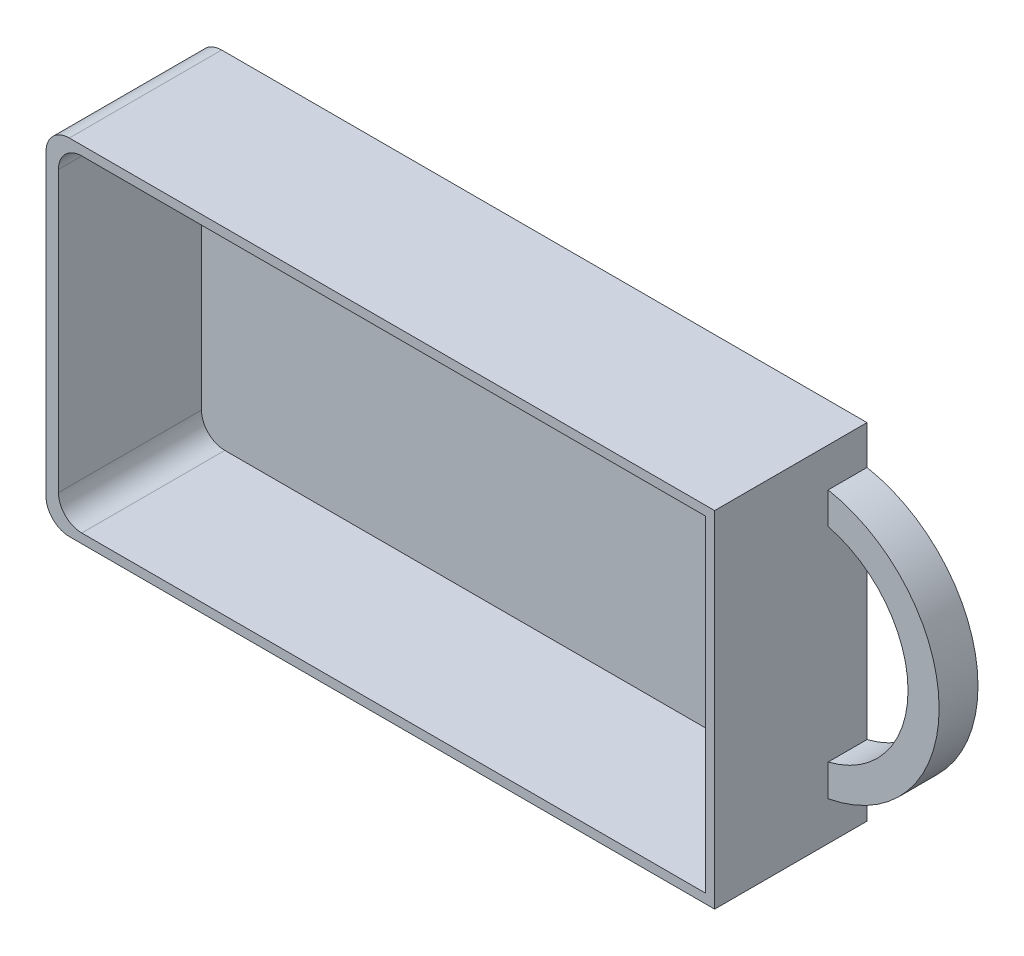
ISO-10303-21;
HEADER;
FILE_DESCRIPTION(('STEP AP214'),'2;1');
FILE_NAME('part.step','',(''),(''),'','','');
FILE_SCHEMA(('AUTOMOTIVE_DESIGN { 1 0 10303 214 1 1 1 1 }'));
ENDSEC;
DATA;
#1=APPLICATION_CONTEXT('core data for automotive mechanical design processes');
#2=APPLICATION_PROTOCOL_DEFINITION('international standard','automotive_design',2000,#1);
#3=PRODUCT_CONTEXT('',#1,'mechanical');
#4=PRODUCT('Part','Part','',(#3));
#5=PRODUCT_RELATED_PRODUCT_CATEGORY('part','',(#4));
#6=PRODUCT_DEFINITION_FORMATION('','',#4);
#7=PRODUCT_DEFINITION_CONTEXT('part definition',#1,'design');
#8=PRODUCT_DEFINITION('design','',#6,#7);
#9=PRODUCT_DEFINITION_SHAPE('','',#8);
#10=(LENGTH_UNIT() NAMED_UNIT(*) SI_UNIT(.MILLI.,.METRE.));
#11=(NAMED_UNIT(*) PLANE_ANGLE_UNIT() SI_UNIT($,.RADIAN.));
#12=(NAMED_UNIT(*) SI_UNIT($,.STERADIAN.) SOLID_ANGLE_UNIT());
#13=UNCERTAINTY_MEASURE_WITH_UNIT(LENGTH_MEASURE(1.E-05),#10,'distance_accuracy_value','');
#14=(GEOMETRIC_REPRESENTATION_CONTEXT(3) GLOBAL_UNCERTAINTY_ASSIGNED_CONTEXT((#13)) GLOBAL_UNIT_ASSIGNED_CONTEXT((#10,
#11,#12)) REPRESENTATION_CONTEXT('',''));
#15=CARTESIAN_POINT('',(0.,0.,0.));
#16=DIRECTION('',(0.,0.,1.));
#17=DIRECTION('',(1.,0.,0.));
#18=AXIS2_PLACEMENT_3D('',#15,#16,#17);
#19=CARTESIAN_POINT('',(43.,22.2,19.6));
#20=DIRECTION('',(-1.,0.,0.));
#21=DIRECTION('',(0.,-1.,0.));
#22=AXIS2_PLACEMENT_3D('',#19,#20,#21);
#23=PLANE('',#22);
#24=DIRECTION('',(0.,0.,-1.));
#25=VECTOR('',#24,1.);
#26=CARTESIAN_POINT('',(43.,-17.2,5.));
#27=LINE('',#26,#25);
#28=CARTESIAN_POINT('',(43.,-17.2,5.));
#29=VERTEX_POINT('',#28);
#30=CARTESIAN_POINT('',(43.,-17.2,0.));
#31=VERTEX_POINT('',#30);
#32=EDGE_CURVE('E204',#29,#31,#27,.T.);
#33=ORIENTED_EDGE('',*,*,#32,.F.);
#34=DIRECTION('',(0.,-1.,0.));
#35=VECTOR('',#34,1.);
#36=CARTESIAN_POINT('',(43.,-17.2,5.));
#37=LINE('',#36,#35);
#38=CARTESIAN_POINT('',(43.,-13.1087756865391,5.));
#39=VERTEX_POINT('',#38);
#40=EDGE_CURVE('E201',#39,#29,#37,.T.);
#41=ORIENTED_EDGE('',*,*,#40,.F.);
#42=DIRECTION('',(0.,0.,-1.));
#43=VECTOR('',#42,1.);
#44=CARTESIAN_POINT('',(43.,-13.1087756865391,5.));
#45=LINE('',#44,#43);
#46=CARTESIAN_POINT('',(43.,-13.1087756865391,0.));
#47=VERTEX_POINT('',#46);
#48=EDGE_CURVE('E211',#39,#47,#45,.T.);
#49=ORIENTED_EDGE('',*,*,#48,.T.);
#50=DIRECTION('',(0.,1.,0.));
#51=VECTOR('',#50,1.);
#52=CARTESIAN_POINT('',(43.,22.2,0.));
#53=LINE('',#52,#51);
#54=CARTESIAN_POINT('',(43.,13.1087756865391,0.));
#55=VERTEX_POINT('',#54);
#56=EDGE_CURVE('E237',#47,#55,#53,.T.);
#57=ORIENTED_EDGE('',*,*,#56,.T.);
#58=DIRECTION('',(0.,0.,-1.));
#59=VECTOR('',#58,1.);
#60=CARTESIAN_POINT('',(43.,13.1087756865391,5.));
#61=LINE('',#60,#59);
#62=CARTESIAN_POINT('',(43.,13.1087756865391,5.));
#63=VERTEX_POINT('',#62);
#64=EDGE_CURVE('E214',#63,#55,#61,.T.);
#65=ORIENTED_EDGE('',*,*,#64,.F.);
#66=DIRECTION('',(0.,-1.,0.));
#67=VECTOR('',#66,1.);
#68=CARTESIAN_POINT('',(43.,17.2,5.));
#69=LINE('',#68,#67);
#70=CARTESIAN_POINT('',(43.,17.2,5.));
#71=VERTEX_POINT('',#70);
#72=EDGE_CURVE('E194',#71,#63,#69,.T.);
#73=ORIENTED_EDGE('',*,*,#72,.F.);
#74=DIRECTION('',(0.,0.,-1.));
#75=VECTOR('',#74,1.);
#76=CARTESIAN_POINT('',(43.,17.2,5.));
#77=LINE('',#76,#75);
#78=CARTESIAN_POINT('',(43.,17.2,0.));
#79=VERTEX_POINT('',#78);
#80=EDGE_CURVE('E217',#71,#79,#77,.T.);
#81=ORIENTED_EDGE('',*,*,#80,.T.);
#82=CARTESIAN_POINT('',(43.,22.2,0.));
#83=VERTEX_POINT('',#82);
#84=EDGE_CURVE('E220',#79,#83,#53,.T.);
#85=ORIENTED_EDGE('',*,*,#84,.T.);
#86=DIRECTION('',(0.,0.,-1.));
#87=VECTOR('',#86,1.);
#88=CARTESIAN_POINT('',(43.,22.2,19.6));
#89=LINE('',#88,#87);
#90=CARTESIAN_POINT('',(43.,22.2,19.6));
#91=VERTEX_POINT('',#90);
#92=EDGE_CURVE('E246',#91,#83,#89,.T.);
#93=ORIENTED_EDGE('',*,*,#92,.F.);
#94=DIRECTION('',(0.,1.,0.));
#95=VECTOR('',#94,1.);
#96=CARTESIAN_POINT('',(43.,22.2,19.6));
#97=LINE('',#96,#95);
#98=CARTESIAN_POINT('',(43.,-22.2,19.6));
#99=VERTEX_POINT('',#98);
#100=EDGE_CURVE('E221',#99,#91,#97,.T.);
#101=ORIENTED_EDGE('',*,*,#100,.F.);
#102=DIRECTION('',(0.,0.,-1.));
#103=VECTOR('',#102,1.);
#104=CARTESIAN_POINT('',(43.,-22.2,19.6));
#105=LINE('',#104,#103);
#106=CARTESIAN_POINT('',(43.,-22.2,0.));
#107=VERTEX_POINT('',#106);
#108=EDGE_CURVE('E233',#99,#107,#105,.T.);
#109=ORIENTED_EDGE('',*,*,#108,.T.);
#110=EDGE_CURVE('E234',#107,#31,#53,.T.);
#111=ORIENTED_EDGE('',*,*,#110,.T.);
#112=EDGE_LOOP('',(#33,#41,#49,#57,#65,#73,#81,#85,#93,#101,#109,#111));
#113=FACE_BOUND('',#112,.T.);
#114=ADVANCED_FACE('F41',(#113),#23,.F.);
#115=CARTESIAN_POINT('',(-43.,22.2,19.6));
#116=DIRECTION('',(0.,-1.,0.));
#117=DIRECTION('',(0.,0.,-1.));
#118=AXIS2_PLACEMENT_3D('',#115,#116,#117);
#119=PLANE('',#118);
#120=DIRECTION('',(-1.,0.,0.));
#121=VECTOR('',#120,1.);
#122=CARTESIAN_POINT('',(-43.,22.2,0.));
#123=LINE('',#122,#121);
#124=CARTESIAN_POINT('',(-40.,22.2,0.));
#125=VERTEX_POINT('',#124);
#126=EDGE_CURVE('E236',#83,#125,#123,.T.);
#127=ORIENTED_EDGE('',*,*,#126,.T.);
#128=DIRECTION('',(0.,0.,-1.));
#129=VECTOR('',#128,1.);
#130=CARTESIAN_POINT('',(-40.,22.2,19.6));
#131=LINE('',#130,#129);
#132=CARTESIAN_POINT('',(-40.,22.2,19.6));
#133=VERTEX_POINT('',#132);
#134=EDGE_CURVE('E258',#125,#133,#131,.F.);
#135=ORIENTED_EDGE('',*,*,#134,.T.);
#136=DIRECTION('',(-1.,0.,0.));
#137=VECTOR('',#136,1.);
#138=CARTESIAN_POINT('',(-43.,22.2,19.6));
#139=LINE('',#138,#137);
#140=EDGE_CURVE('E224',#91,#133,#139,.T.);
#141=ORIENTED_EDGE('',*,*,#140,.F.);
#142=ORIENTED_EDGE('',*,*,#92,.T.);
#143=EDGE_LOOP('',(#127,#135,#141,#142));
#144=FACE_BOUND('',#143,.T.);
#145=ADVANCED_FACE('F297',(#144),#119,.F.);
#146=CARTESIAN_POINT('',(-43.,22.2,19.6));
#147=DIRECTION('',(1.,0.,0.));
#148=DIRECTION('',(0.,1.,0.));
#149=AXIS2_PLACEMENT_3D('',#146,#147,#148);
#150=PLANE('',#149);
#151=DIRECTION('',(0.,-1.,0.));
#152=VECTOR('',#151,1.);
#153=CARTESIAN_POINT('',(-43.,22.2,19.6));
#154=LINE('',#153,#152);
#155=CARTESIAN_POINT('',(-43.,19.2,19.6));
#156=VERTEX_POINT('',#155);
#157=CARTESIAN_POINT('',(-43.,-19.2,19.6));
#158=VERTEX_POINT('',#157);
#159=EDGE_CURVE('E228',#156,#158,#154,.T.);
#160=ORIENTED_EDGE('',*,*,#159,.F.);
#161=DIRECTION('',(0.,0.,-1.));
#162=VECTOR('',#161,1.);
#163=CARTESIAN_POINT('',(-43.,19.2,19.6));
#164=LINE('',#163,#162);
#165=CARTESIAN_POINT('',(-43.,19.2,0.));
#166=VERTEX_POINT('',#165);
#167=EDGE_CURVE('E251',#156,#166,#164,.T.);
#168=ORIENTED_EDGE('',*,*,#167,.T.);
#169=DIRECTION('',(0.,-1.,0.));
#170=VECTOR('',#169,1.);
#171=CARTESIAN_POINT('',(-43.,22.2,0.));
#172=LINE('',#171,#170);
#173=CARTESIAN_POINT('',(-43.,-19.2,0.));
#174=VERTEX_POINT('',#173);
#175=EDGE_CURVE('E240',#166,#174,#172,.T.);
#176=ORIENTED_EDGE('',*,*,#175,.T.);
#177=DIRECTION('',(0.,0.,-1.));
#178=VECTOR('',#177,1.);
#179=CARTESIAN_POINT('',(-43.,-19.2,19.6));
#180=LINE('',#179,#178);
#181=EDGE_CURVE('E249',#174,#158,#180,.F.);
#182=ORIENTED_EDGE('',*,*,#181,.T.);
#183=EDGE_LOOP('',(#160,#168,#176,#182));
#184=FACE_BOUND('',#183,.T.);
#185=ADVANCED_FACE('F303',(#184),#150,.F.);
#186=CARTESIAN_POINT('',(-43.,-22.2,19.6));
#187=DIRECTION('',(0.,1.,0.));
#188=DIRECTION('',(0.,0.,1.));
#189=AXIS2_PLACEMENT_3D('',#186,#187,#188);
#190=PLANE('',#189);
#191=DIRECTION('',(1.,0.,0.));
#192=VECTOR('',#191,1.);
#193=CARTESIAN_POINT('',(-43.,-22.2,19.6));
#194=LINE('',#193,#192);
#195=CARTESIAN_POINT('',(-40.,-22.2,19.6));
#196=VERTEX_POINT('',#195);
#197=EDGE_CURVE('E231',#196,#99,#194,.T.);
#198=ORIENTED_EDGE('',*,*,#197,.F.);
#199=DIRECTION('',(0.,0.,-1.));
#200=VECTOR('',#199,1.);
#201=CARTESIAN_POINT('',(-40.,-22.2,19.6));
#202=LINE('',#201,#200);
#203=CARTESIAN_POINT('',(-40.,-22.2,0.));
#204=VERTEX_POINT('',#203);
#205=EDGE_CURVE('E264',#196,#204,#202,.T.);
#206=ORIENTED_EDGE('',*,*,#205,.T.);
#207=DIRECTION('',(1.,0.,0.));
#208=VECTOR('',#207,1.);
#209=CARTESIAN_POINT('',(-43.,-22.2,0.));
#210=LINE('',#209,#208);
#211=EDGE_CURVE('E225',#204,#107,#210,.T.);
#212=ORIENTED_EDGE('',*,*,#211,.T.);
#213=ORIENTED_EDGE('',*,*,#108,.F.);
#214=EDGE_LOOP('',(#198,#206,#212,#213));
#215=FACE_BOUND('',#214,.T.);
#216=ADVANCED_FACE('F323',(#215),#190,.F.);
#217=CARTESIAN_POINT('',(0.,0.,19.6));
#218=DIRECTION('',(0.,0.,1.));
#219=DIRECTION('',(1.,0.,0.));
#220=AXIS2_PLACEMENT_3D('',#217,#218,#219);
#221=PLANE('',#220);
#222=DIRECTION('',(0.,-1.,0.));
#223=VECTOR('',#222,1.);
#224=CARTESIAN_POINT('',(-41.4,21.,19.6));
#225=LINE('',#224,#223);
#226=CARTESIAN_POINT('',(-41.4,18.,19.6));
#227=VERTEX_POINT('',#226);
#228=CARTESIAN_POINT('',(-41.4,-18.,19.6));
#229=VERTEX_POINT('',#228);
#230=EDGE_CURVE('E167',#227,#229,#225,.T.);
#231=ORIENTED_EDGE('',*,*,#230,.F.);
#232=CARTESIAN_POINT('',(-38.4,18.,19.6));
#233=DIRECTION('',(0.,0.,1.));
#234=DIRECTION('',(1.,0.,0.));
#235=AXIS2_PLACEMENT_3D('',#232,#233,#234);
#236=CIRCLE('',#235,3.);
#237=CARTESIAN_POINT('',(-38.4,21.,19.6));
#238=VERTEX_POINT('',#237);
#239=EDGE_CURVE('E12',#227,#238,#236,.F.);
#240=ORIENTED_EDGE('',*,*,#239,.T.);
#241=DIRECTION('',(-1.,0.,0.));
#242=VECTOR('',#241,1.);
#243=CARTESIAN_POINT('',(41.8,21.,19.6));
#244=LINE('',#243,#242);
#245=CARTESIAN_POINT('',(41.8,21.,19.6));
#246=VERTEX_POINT('',#245);
#247=EDGE_CURVE('E177',#246,#238,#244,.T.);
#248=ORIENTED_EDGE('',*,*,#247,.F.);
#249=DIRECTION('',(0.,1.,0.));
#250=VECTOR('',#249,1.);
#251=CARTESIAN_POINT('',(41.8,-21.,19.6));
#252=LINE('',#251,#250);
#253=CARTESIAN_POINT('',(41.8,-21.,19.6));
#254=VERTEX_POINT('',#253);
#255=EDGE_CURVE('E166',#254,#246,#252,.T.);
#256=ORIENTED_EDGE('',*,*,#255,.F.);
#257=DIRECTION('',(1.,0.,0.));
#258=VECTOR('',#257,1.);
#259=CARTESIAN_POINT('',(-41.4,-21.,19.6));
#260=LINE('',#259,#258);
#261=CARTESIAN_POINT('',(-38.4,-21.,19.6));
#262=VERTEX_POINT('',#261);
#263=EDGE_CURVE('E156',#262,#254,#260,.T.);
#264=ORIENTED_EDGE('',*,*,#263,.F.);
#265=CARTESIAN_POINT('',(-38.4,-18.,19.6));
#266=DIRECTION('',(0.,0.,1.));
#267=DIRECTION('',(1.,0.,0.));
#268=AXIS2_PLACEMENT_3D('',#265,#266,#267);
#269=CIRCLE('',#268,3.);
#270=EDGE_CURVE('E49',#262,#229,#269,.F.);
#271=ORIENTED_EDGE('',*,*,#270,.T.);
#272=EDGE_LOOP('',(#231,#240,#248,#256,#264,#271));
#273=FACE_BOUND('',#272,.T.);
#274=ORIENTED_EDGE('',*,*,#140,.T.);
#275=CARTESIAN_POINT('',(-40.,19.2,19.6));
#276=DIRECTION('',(0.,0.,1.));
#277=DIRECTION('',(1.,0.,0.));
#278=AXIS2_PLACEMENT_3D('',#275,#276,#277);
#279=CIRCLE('',#278,3.);
#280=EDGE_CURVE('E262',#133,#156,#279,.T.);
#281=ORIENTED_EDGE('',*,*,#280,.T.);
#282=ORIENTED_EDGE('',*,*,#159,.T.);
#283=CARTESIAN_POINT('',(-40.,-19.2,19.6));
#284=DIRECTION('',(0.,0.,1.));
#285=DIRECTION('',(1.,0.,0.));
#286=AXIS2_PLACEMENT_3D('',#283,#284,#285);
#287=CIRCLE('',#286,3.);
#288=EDGE_CURVE('E260',#158,#196,#287,.T.);
#289=ORIENTED_EDGE('',*,*,#288,.T.);
#290=ORIENTED_EDGE('',*,*,#197,.T.);
#291=ORIENTED_EDGE('',*,*,#100,.T.);
#292=EDGE_LOOP('',(#274,#281,#282,#289,#290,#291));
#293=FACE_BOUND('',#292,.T.);
#294=ADVANCED_FACE('F180',(#273,#293),#221,.T.);
#295=CARTESIAN_POINT('',(0.,0.,0.));
#296=DIRECTION('',(0.,0.,1.));
#297=DIRECTION('',(1.,0.,0.));
#298=AXIS2_PLACEMENT_3D('',#295,#296,#297);
#299=PLANE('',#298);
#300=CARTESIAN_POINT('',(39.7735468390197,0.,0.));
#301=DIRECTION('',(0.,0.,-1.));
#302=DIRECTION('',(1.,0.,0.));
#303=AXIS2_PLACEMENT_3D('',#300,#301,#302);
#304=CIRCLE('',#303,13.5);
#305=EDGE_CURVE('E195',#55,#47,#304,.T.);
#306=ORIENTED_EDGE('',*,*,#305,.F.);
#307=ORIENTED_EDGE('',*,*,#56,.F.);
#308=EDGE_LOOP('',(#306,#307));
#309=FACE_BOUND('',#308,.T.);
#310=ORIENTED_EDGE('',*,*,#175,.F.);
#311=CARTESIAN_POINT('',(-40.,19.2,0.));
#312=DIRECTION('',(0.,0.,1.));
#313=DIRECTION('',(1.,0.,0.));
#314=AXIS2_PLACEMENT_3D('',#311,#312,#313);
#315=CIRCLE('',#314,3.);
#316=EDGE_CURVE('E256',#166,#125,#315,.F.);
#317=ORIENTED_EDGE('',*,*,#316,.T.);
#318=ORIENTED_EDGE('',*,*,#126,.F.);
#319=ORIENTED_EDGE('',*,*,#84,.F.);
#320=CARTESIAN_POINT('',(39.7735468390197,0.,0.));
#321=DIRECTION('',(0.,0.,1.));
#322=DIRECTION('',(1.,0.,0.));
#323=AXIS2_PLACEMENT_3D('',#320,#321,#322);
#324=CIRCLE('',#323,17.5);
#325=EDGE_CURVE('E189',#31,#79,#324,.T.);
#326=ORIENTED_EDGE('',*,*,#325,.F.);
#327=ORIENTED_EDGE('',*,*,#110,.F.);
#328=ORIENTED_EDGE('',*,*,#211,.F.);
#329=CARTESIAN_POINT('',(-40.,-19.2,0.));
#330=DIRECTION('',(0.,0.,1.));
#331=DIRECTION('',(1.,0.,0.));
#332=AXIS2_PLACEMENT_3D('',#329,#330,#331);
#333=CIRCLE('',#332,3.);
#334=EDGE_CURVE('E254',#204,#174,#333,.F.);
#335=ORIENTED_EDGE('',*,*,#334,.T.);
#336=EDGE_LOOP('',(#310,#317,#318,#319,#326,#327,#328,#335));
#337=FACE_BOUND('',#336,.T.);
#338=ADVANCED_FACE('F334',(#309,#337),#299,.F.);
#339=CARTESIAN_POINT('',(39.7735468390197,0.,5.));
#340=DIRECTION('',(0.,0.,-1.));
#341=DIRECTION('',(-1.,0.,0.));
#342=AXIS2_PLACEMENT_3D('',#339,#340,#341);
#343=CYLINDRICAL_SURFACE('',#342,17.5);
#344=ORIENTED_EDGE('',*,*,#325,.T.);
#345=ORIENTED_EDGE('',*,*,#80,.F.);
#346=CARTESIAN_POINT('',(39.7735468390197,0.,5.));
#347=DIRECTION('',(0.,0.,1.));
#348=DIRECTION('',(1.,0.,0.));
#349=AXIS2_PLACEMENT_3D('',#346,#347,#348);
#350=CIRCLE('',#349,17.5);
#351=EDGE_CURVE('E191',#29,#71,#350,.T.);
#352=ORIENTED_EDGE('',*,*,#351,.F.);
#353=ORIENTED_EDGE('',*,*,#32,.T.);
#354=EDGE_LOOP('',(#344,#345,#352,#353));
#355=FACE_BOUND('',#354,.T.);
#356=ADVANCED_FACE('F339',(#355),#343,.T.);
#357=CARTESIAN_POINT('',(39.7735468390197,0.,5.));
#358=DIRECTION('',(0.,0.,-1.));
#359=DIRECTION('',(-1.,0.,0.));
#360=AXIS2_PLACEMENT_3D('',#357,#358,#359);
#361=CYLINDRICAL_SURFACE('',#360,13.5);
#362=ORIENTED_EDGE('',*,*,#305,.T.);
#363=ORIENTED_EDGE('',*,*,#48,.F.);
#364=CARTESIAN_POINT('',(39.7735468390197,0.,5.));
#365=DIRECTION('',(0.,0.,-1.));
#366=DIRECTION('',(1.,0.,0.));
#367=AXIS2_PLACEMENT_3D('',#364,#365,#366);
#368=CIRCLE('',#367,13.5);
#369=EDGE_CURVE('E198',#63,#39,#368,.T.);
#370=ORIENTED_EDGE('',*,*,#369,.F.);
#371=ORIENTED_EDGE('',*,*,#64,.T.);
#372=EDGE_LOOP('',(#362,#363,#370,#371));
#373=FACE_BOUND('',#372,.T.);
#374=ADVANCED_FACE('F347',(#373),#361,.F.);
#375=CARTESIAN_POINT('',(39.7735468390197,0.,5.));
#376=DIRECTION('',(0.,0.,1.));
#377=DIRECTION('',(1.,0.,0.));
#378=AXIS2_PLACEMENT_3D('',#375,#376,#377);
#379=PLANE('',#378);
#380=ORIENTED_EDGE('',*,*,#351,.T.);
#381=ORIENTED_EDGE('',*,*,#72,.T.);
#382=ORIENTED_EDGE('',*,*,#369,.T.);
#383=ORIENTED_EDGE('',*,*,#40,.T.);
#384=EDGE_LOOP('',(#380,#381,#382,#383));
#385=FACE_BOUND('',#384,.T.);
#386=ADVANCED_FACE('F342',(#385),#379,.T.);
#387=CARTESIAN_POINT('',(-41.4,21.,-93.2));
#388=DIRECTION('',(-1.,0.,0.));
#389=DIRECTION('',(0.,-1.,0.));
#390=AXIS2_PLACEMENT_3D('',#387,#388,#389);
#391=PLANE('',#390);
#392=ORIENTED_EDGE('',*,*,#230,.T.);
#393=DIRECTION('',(0.,0.,1.));
#394=VECTOR('',#393,1.);
#395=CARTESIAN_POINT('',(-41.4,-18.,1.20000000000001));
#396=LINE('',#395,#394);
#397=CARTESIAN_POINT('',(-41.4,-18.,1.20000000000001));
#398=VERTEX_POINT('',#397);
#399=EDGE_CURVE('E271',#229,#398,#396,.F.);
#400=ORIENTED_EDGE('',*,*,#399,.T.);
#401=DIRECTION('',(0.,1.,0.));
#402=VECTOR('',#401,1.);
#403=CARTESIAN_POINT('',(-41.4,21.,1.20000000000001));
#404=LINE('',#403,#402);
#405=CARTESIAN_POINT('',(-41.4,18.,1.20000000000001));
#406=VERTEX_POINT('',#405);
#407=EDGE_CURVE('E190',#398,#406,#404,.T.);
#408=ORIENTED_EDGE('',*,*,#407,.T.);
#409=DIRECTION('',(0.,0.,1.));
#410=VECTOR('',#409,1.);
#411=CARTESIAN_POINT('',(-41.4,18.,19.6));
#412=LINE('',#411,#410);
#413=EDGE_CURVE('E268',#406,#227,#412,.T.);
#414=ORIENTED_EDGE('',*,*,#413,.T.);
#415=EDGE_LOOP('',(#392,#400,#408,#414));
#416=FACE_BOUND('',#415,.T.);
#417=ADVANCED_FACE('F280',(#416),#391,.F.);
#418=CARTESIAN_POINT('',(41.8,21.,-93.2));
#419=DIRECTION('',(0.,1.,0.));
#420=DIRECTION('',(0.,0.,1.));
#421=AXIS2_PLACEMENT_3D('',#418,#419,#420);
#422=PLANE('',#421);
#423=ORIENTED_EDGE('',*,*,#247,.T.);
#424=DIRECTION('',(0.,0.,1.));
#425=VECTOR('',#424,1.);
#426=CARTESIAN_POINT('',(-38.4,21.,1.20000000000001));
#427=LINE('',#426,#425);
#428=CARTESIAN_POINT('',(-38.4,21.,1.20000000000001));
#429=VERTEX_POINT('',#428);
#430=EDGE_CURVE('E56',#238,#429,#427,.F.);
#431=ORIENTED_EDGE('',*,*,#430,.T.);
#432=DIRECTION('',(1.,0.,0.));
#433=VECTOR('',#432,1.);
#434=CARTESIAN_POINT('',(41.8,21.,1.20000000000001));
#435=LINE('',#434,#433);
#436=CARTESIAN_POINT('',(41.8,21.,1.20000000000001));
#437=VERTEX_POINT('',#436);
#438=EDGE_CURVE('E285',#429,#437,#435,.T.);
#439=ORIENTED_EDGE('',*,*,#438,.T.);
#440=DIRECTION('',(0.,0.,1.));
#441=VECTOR('',#440,1.);
#442=CARTESIAN_POINT('',(41.8,21.,-93.2));
#443=LINE('',#442,#441);
#444=EDGE_CURVE('E176',#437,#246,#443,.T.);
#445=ORIENTED_EDGE('',*,*,#444,.T.);
#446=EDGE_LOOP('',(#423,#431,#439,#445));
#447=FACE_BOUND('',#446,.T.);
#448=ADVANCED_FACE('F289',(#447),#422,.F.);
#449=CARTESIAN_POINT('',(41.8,-21.,-93.2));
#450=DIRECTION('',(1.,0.,0.));
#451=DIRECTION('',(0.,1.,0.));
#452=AXIS2_PLACEMENT_3D('',#449,#450,#451);
#453=PLANE('',#452);
#454=DIRECTION('',(0.,-1.,0.));
#455=VECTOR('',#454,1.);
#456=CARTESIAN_POINT('',(41.8,-21.,1.20000000000001));
#457=LINE('',#456,#455);
#458=CARTESIAN_POINT('',(41.8,-21.,1.19999999999998));
#459=VERTEX_POINT('',#458);
#460=EDGE_CURVE('E175',#437,#459,#457,.T.);
#461=ORIENTED_EDGE('',*,*,#460,.T.);
#462=DIRECTION('',(0.,0.,1.));
#463=VECTOR('',#462,1.);
#464=CARTESIAN_POINT('',(41.8,-21.,-93.2));
#465=LINE('',#464,#463);
#466=EDGE_CURVE('E160',#459,#254,#465,.T.);
#467=ORIENTED_EDGE('',*,*,#466,.T.);
#468=ORIENTED_EDGE('',*,*,#255,.T.);
#469=ORIENTED_EDGE('',*,*,#444,.F.);
#470=EDGE_LOOP('',(#461,#467,#468,#469));
#471=FACE_BOUND('',#470,.T.);
#472=ADVANCED_FACE('F171',(#471),#453,.F.);
#473=CARTESIAN_POINT('',(-41.4,-21.,-93.2));
#474=DIRECTION('',(0.,-1.,0.));
#475=DIRECTION('',(0.,0.,-1.));
#476=AXIS2_PLACEMENT_3D('',#473,#474,#475);
#477=PLANE('',#476);
#478=DIRECTION('',(-1.,0.,0.));
#479=VECTOR('',#478,1.);
#480=CARTESIAN_POINT('',(-41.4,-21.,1.20000000000001));
#481=LINE('',#480,#479);
#482=CARTESIAN_POINT('',(-38.4,-21.,1.20000000000001));
#483=VERTEX_POINT('',#482);
#484=EDGE_CURVE('E187',#459,#483,#481,.T.);
#485=ORIENTED_EDGE('',*,*,#484,.T.);
#486=DIRECTION('',(0.,0.,1.));
#487=VECTOR('',#486,1.);
#488=CARTESIAN_POINT('',(-38.4,-21.,19.6));
#489=LINE('',#488,#487);
#490=EDGE_CURVE('E163',#483,#262,#489,.T.);
#491=ORIENTED_EDGE('',*,*,#490,.T.);
#492=ORIENTED_EDGE('',*,*,#263,.T.);
#493=ORIENTED_EDGE('',*,*,#466,.F.);
#494=EDGE_LOOP('',(#485,#491,#492,#493));
#495=FACE_BOUND('',#494,.T.);
#496=ADVANCED_FACE('F159',(#495),#477,.F.);
#497=CARTESIAN_POINT('',(0.,0.,1.2));
#498=DIRECTION('',(0.,0.,1.));
#499=DIRECTION('',(1.,0.,0.));
#500=AXIS2_PLACEMENT_3D('',#497,#498,#499);
#501=PLANE('',#500);
#502=ORIENTED_EDGE('',*,*,#407,.F.);
#503=CARTESIAN_POINT('',(-38.4,-18.,1.20000000000001));
#504=DIRECTION('',(0.,0.,1.));
#505=DIRECTION('',(1.,0.,0.));
#506=AXIS2_PLACEMENT_3D('',#503,#504,#505);
#507=CIRCLE('',#506,3.);
#508=EDGE_CURVE('E274',#398,#483,#507,.T.);
#509=ORIENTED_EDGE('',*,*,#508,.T.);
#510=ORIENTED_EDGE('',*,*,#484,.F.);
#511=ORIENTED_EDGE('',*,*,#460,.F.);
#512=ORIENTED_EDGE('',*,*,#438,.F.);
#513=CARTESIAN_POINT('',(-38.4,18.,1.20000000000001));
#514=DIRECTION('',(0.,0.,1.));
#515=DIRECTION('',(1.,0.,0.));
#516=AXIS2_PLACEMENT_3D('',#513,#514,#515);
#517=CIRCLE('',#516,3.);
#518=EDGE_CURVE('E63',#429,#406,#517,.T.);
#519=ORIENTED_EDGE('',*,*,#518,.T.);
#520=EDGE_LOOP('',(#502,#509,#510,#511,#512,#519));
#521=FACE_BOUND('',#520,.T.);
#522=ADVANCED_FACE('F284',(#521),#501,.T.);
#523=CARTESIAN_POINT('',(-40.,19.2,19.6));
#524=DIRECTION('',(0.,0.,-1.));
#525=DIRECTION('',(-1.,0.,0.));
#526=AXIS2_PLACEMENT_3D('',#523,#524,#525);
#527=CYLINDRICAL_SURFACE('',#526,3.);
#528=ORIENTED_EDGE('',*,*,#280,.F.);
#529=ORIENTED_EDGE('',*,*,#134,.F.);
#530=ORIENTED_EDGE('',*,*,#316,.F.);
#531=ORIENTED_EDGE('',*,*,#167,.F.);
#532=EDGE_LOOP('',(#528,#529,#530,#531));
#533=FACE_BOUND('',#532,.T.);
#534=ADVANCED_FACE('F308',(#533),#527,.T.);
#535=CARTESIAN_POINT('',(-40.,-19.2,19.6));
#536=DIRECTION('',(0.,0.,-1.));
#537=DIRECTION('',(-1.,0.,0.));
#538=AXIS2_PLACEMENT_3D('',#535,#536,#537);
#539=CYLINDRICAL_SURFACE('',#538,3.);
#540=ORIENTED_EDGE('',*,*,#288,.F.);
#541=ORIENTED_EDGE('',*,*,#181,.F.);
#542=ORIENTED_EDGE('',*,*,#334,.F.);
#543=ORIENTED_EDGE('',*,*,#205,.F.);
#544=EDGE_LOOP('',(#540,#541,#542,#543));
#545=FACE_BOUND('',#544,.T.);
#546=ADVANCED_FACE('F295',(#545),#539,.T.);
#547=CARTESIAN_POINT('',(-38.4,-18.,-93.2));
#548=DIRECTION('',(0.,0.,-1.));
#549=DIRECTION('',(-1.,0.,0.));
#550=AXIS2_PLACEMENT_3D('',#547,#548,#549);
#551=CYLINDRICAL_SURFACE('',#550,3.);
#552=ORIENTED_EDGE('',*,*,#508,.F.);
#553=ORIENTED_EDGE('',*,*,#399,.F.);
#554=ORIENTED_EDGE('',*,*,#270,.F.);
#555=ORIENTED_EDGE('',*,*,#490,.F.);
#556=EDGE_LOOP('',(#552,#553,#554,#555));
#557=FACE_BOUND('',#556,.T.);
#558=ADVANCED_FACE('F283',(#557),#551,.F.);
#559=CARTESIAN_POINT('',(-38.4,18.,-93.2));
#560=DIRECTION('',(0.,0.,-1.));
#561=DIRECTION('',(-1.,0.,0.));
#562=AXIS2_PLACEMENT_3D('',#559,#560,#561);
#563=CYLINDRICAL_SURFACE('',#562,3.);
#564=ORIENTED_EDGE('',*,*,#518,.F.);
#565=ORIENTED_EDGE('',*,*,#430,.F.);
#566=ORIENTED_EDGE('',*,*,#239,.F.);
#567=ORIENTED_EDGE('',*,*,#413,.F.);
#568=EDGE_LOOP('',(#564,#565,#566,#567));
#569=FACE_BOUND('',#568,.T.);
#570=ADVANCED_FACE('F43',(#569),#563,.F.);
#571=CLOSED_SHELL('',(#114,#145,#185,#216,#294,#338,#356,#374,#386,#417,#448,#472,#496,#522,
#534,#546,#558,#570));
#572=MANIFOLD_SOLID_BREP('B2',#571);
#573=ADVANCED_BREP_SHAPE_REPRESENTATION('',(#18,#572),#14);
#574=SHAPE_DEFINITION_REPRESENTATION(#9,#573);
ENDSEC;
END-ISO-10303-21;
